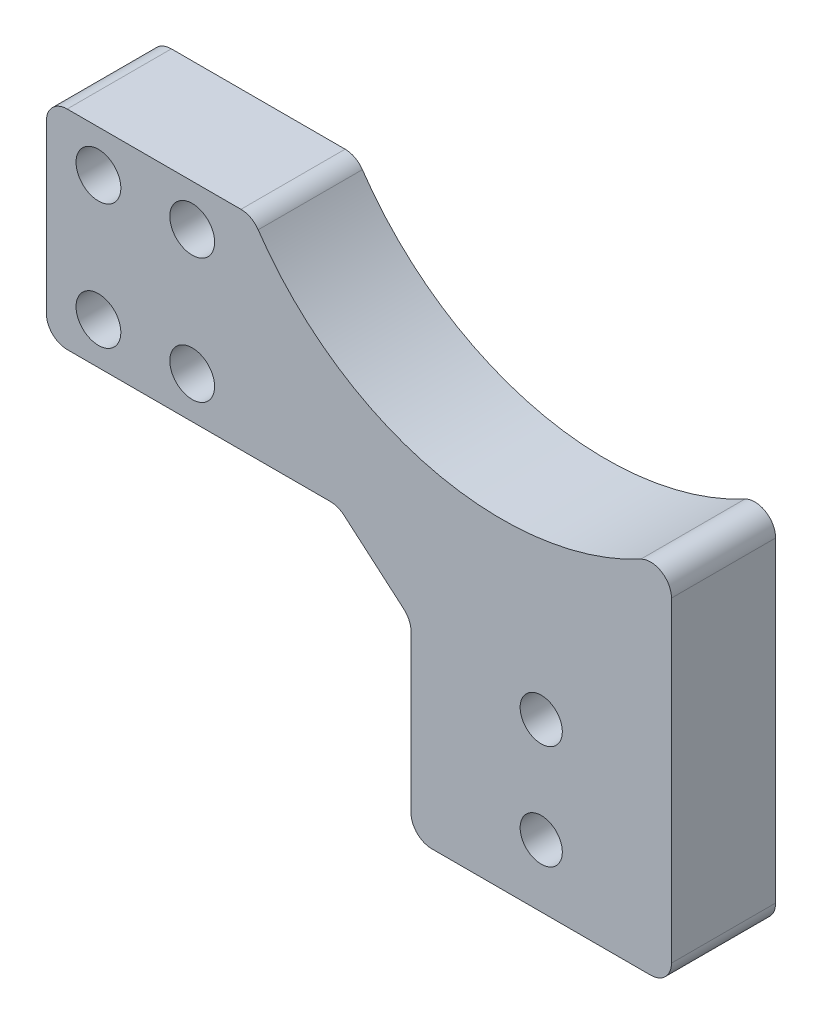
ISO-10303-21;
HEADER;
FILE_DESCRIPTION(('STEP AP214'),'2;1');
FILE_NAME('part.step','',(''),(''),'','','');
FILE_SCHEMA(('AUTOMOTIVE_DESIGN { 1 0 10303 214 1 1 1 1 }'));
ENDSEC;
DATA;
#1=APPLICATION_CONTEXT('core data for automotive mechanical design processes');
#2=APPLICATION_PROTOCOL_DEFINITION('international standard','automotive_design',2000,#1);
#3=PRODUCT_CONTEXT('',#1,'mechanical');
#4=PRODUCT('Part','Part','',(#3));
#5=PRODUCT_RELATED_PRODUCT_CATEGORY('part','',(#4));
#6=PRODUCT_DEFINITION_FORMATION('','',#4);
#7=PRODUCT_DEFINITION_CONTEXT('part definition',#1,'design');
#8=PRODUCT_DEFINITION('design','',#6,#7);
#9=PRODUCT_DEFINITION_SHAPE('','',#8);
#10=(LENGTH_UNIT() NAMED_UNIT(*) SI_UNIT(.MILLI.,.METRE.));
#11=(NAMED_UNIT(*) PLANE_ANGLE_UNIT() SI_UNIT($,.RADIAN.));
#12=(NAMED_UNIT(*) SI_UNIT($,.STERADIAN.) SOLID_ANGLE_UNIT());
#13=UNCERTAINTY_MEASURE_WITH_UNIT(LENGTH_MEASURE(1.E-05),#10,'distance_accuracy_value','');
#14=(GEOMETRIC_REPRESENTATION_CONTEXT(3) GLOBAL_UNCERTAINTY_ASSIGNED_CONTEXT((#13)) GLOBAL_UNIT_ASSIGNED_CONTEXT((#10,
#11,#12)) REPRESENTATION_CONTEXT('',''));
#15=CARTESIAN_POINT('',(0.,0.,0.));
#16=DIRECTION('',(0.,0.,1.));
#17=DIRECTION('',(1.,0.,0.));
#18=AXIS2_PLACEMENT_3D('',#15,#16,#17);
#19=CARTESIAN_POINT('',(-7.,6.,5.));
#20=DIRECTION('',(0.650791373455969,0.759256602365296,0.));
#21=DIRECTION('',(-0.759256602365296,0.650791373455969,0.));
#22=AXIS2_PLACEMENT_3D('',#19,#20,#21);
#23=PLANE('',#22);
#24=DIRECTION('',(0.759256602365296,-0.650791373455969,0.));
#25=VECTOR('',#24,1.);
#26=CARTESIAN_POINT('',(-7.,6.,5.));
#27=LINE('',#26,#25);
#28=CARTESIAN_POINT('',(-6.43826540551902,5.51851320473059,5.));
#29=VERTEX_POINT('',#28);
#30=CARTESIAN_POINT('',(-0.698417253088064,0.598643359789769,5.));
#31=VERTEX_POINT('',#30);
#32=EDGE_CURVE('E169',#29,#31,#27,.T.);
#33=ORIENTED_EDGE('',*,*,#32,.F.);
#34=DIRECTION('',(0.,0.,-1.));
#35=VECTOR('',#34,1.);
#36=CARTESIAN_POINT('',(-6.43826540551902,5.51851320473059,-5.));
#37=LINE('',#36,#35);
#38=CARTESIAN_POINT('',(-6.43826540551902,5.51851320473059,-5.));
#39=VERTEX_POINT('',#38);
#40=EDGE_CURVE('E155',#29,#39,#37,.T.);
#41=ORIENTED_EDGE('',*,*,#40,.T.);
#42=DIRECTION('',(0.759256602365296,-0.650791373455969,0.));
#43=VECTOR('',#42,1.);
#44=CARTESIAN_POINT('',(-7.,6.,-5.));
#45=LINE('',#44,#43);
#46=CARTESIAN_POINT('',(-0.698417253088064,0.598643359789769,-5.));
#47=VERTEX_POINT('',#46);
#48=EDGE_CURVE('E166',#39,#47,#45,.T.);
#49=ORIENTED_EDGE('',*,*,#48,.T.);
#50=DIRECTION('',(0.,0.,-1.));
#51=VECTOR('',#50,1.);
#52=CARTESIAN_POINT('',(-0.698417253088063,0.598643359789768,5.));
#53=LINE('',#52,#51);
#54=EDGE_CURVE('E171',#47,#31,#53,.F.);
#55=ORIENTED_EDGE('',*,*,#54,.T.);
#56=EDGE_LOOP('',(#33,#41,#49,#55));
#57=FACE_BOUND('',#56,.T.);
#58=ADVANCED_FACE('F35',(#57),#23,.F.);
#59=CARTESIAN_POINT('',(0.,0.,5.));
#60=DIRECTION('',(1.,0.,0.));
#61=DIRECTION('',(0.,1.,0.));
#62=AXIS2_PLACEMENT_3D('',#59,#60,#61);
#63=PLANE('',#62);
#64=DIRECTION('',(0.,-1.,0.));
#65=VECTOR('',#64,1.);
#66=CARTESIAN_POINT('',(0.,0.,-5.));
#67=LINE('',#66,#65);
#68=CARTESIAN_POINT('',(0.,-0.919869844940825,-5.));
#69=VERTEX_POINT('',#68);
#70=CARTESIAN_POINT('',(0.,-16.,-5.));
#71=VERTEX_POINT('',#70);
#72=EDGE_CURVE('E176',#69,#71,#67,.T.);
#73=ORIENTED_EDGE('',*,*,#72,.T.);
#74=DIRECTION('',(0.,0.,1.));
#75=VECTOR('',#74,1.);
#76=CARTESIAN_POINT('',(0.,-16.,5.));
#77=LINE('',#76,#75);
#78=CARTESIAN_POINT('',(0.,-16.,5.));
#79=VERTEX_POINT('',#78);
#80=EDGE_CURVE('E11',#71,#79,#77,.T.);
#81=ORIENTED_EDGE('',*,*,#80,.T.);
#82=DIRECTION('',(0.,-1.,0.));
#83=VECTOR('',#82,1.);
#84=CARTESIAN_POINT('',(0.,0.,5.));
#85=LINE('',#84,#83);
#86=CARTESIAN_POINT('',(0.,-0.919869844940825,5.));
#87=VERTEX_POINT('',#86);
#88=EDGE_CURVE('E277',#87,#79,#85,.T.);
#89=ORIENTED_EDGE('',*,*,#88,.F.);
#90=DIRECTION('',(0.,0.,-1.));
#91=VECTOR('',#90,1.);
#92=CARTESIAN_POINT('',(0.,-0.919869844940825,-5.));
#93=LINE('',#92,#91);
#94=EDGE_CURVE('E217',#87,#69,#93,.T.);
#95=ORIENTED_EDGE('',*,*,#94,.T.);
#96=EDGE_LOOP('',(#73,#81,#89,#95));
#97=FACE_BOUND('',#96,.T.);
#98=ADVANCED_FACE('F333',(#97),#63,.F.);
#99=CARTESIAN_POINT('',(25.,-24.,5.));
#100=DIRECTION('',(-1.,0.,0.));
#101=DIRECTION('',(0.,-1.,0.));
#102=AXIS2_PLACEMENT_3D('',#99,#100,#101);
#103=PLANE('',#102);
#104=DIRECTION('',(0.,1.,0.));
#105=VECTOR('',#104,1.);
#106=CARTESIAN_POINT('',(25.,-24.,5.));
#107=LINE('',#106,#105);
#108=CARTESIAN_POINT('',(25.,-16.,5.));
#109=VERTEX_POINT('',#108);
#110=CARTESIAN_POINT('',(25.,14.3434342046842,5.));
#111=VERTEX_POINT('',#110);
#112=EDGE_CURVE('E272',#109,#111,#107,.T.);
#113=ORIENTED_EDGE('',*,*,#112,.F.);
#114=DIRECTION('',(0.,0.,1.));
#115=VECTOR('',#114,1.);
#116=CARTESIAN_POINT('',(25.,-16.,5.));
#117=LINE('',#116,#115);
#118=CARTESIAN_POINT('',(25.,-16.,-5.));
#119=VERTEX_POINT('',#118);
#120=EDGE_CURVE('E58',#109,#119,#117,.F.);
#121=ORIENTED_EDGE('',*,*,#120,.T.);
#122=DIRECTION('',(0.,1.,0.));
#123=VECTOR('',#122,1.);
#124=CARTESIAN_POINT('',(25.,-24.,-5.));
#125=LINE('',#124,#123);
#126=CARTESIAN_POINT('',(25.,14.3434342046842,-5.));
#127=VERTEX_POINT('',#126);
#128=EDGE_CURVE('E179',#119,#127,#125,.T.);
#129=ORIENTED_EDGE('',*,*,#128,.T.);
#130=DIRECTION('',(0.,0.,-1.));
#131=VECTOR('',#130,1.);
#132=CARTESIAN_POINT('',(25.,14.3434342046842,5.));
#133=LINE('',#132,#131);
#134=EDGE_CURVE('E236',#127,#111,#133,.F.);
#135=ORIENTED_EDGE('',*,*,#134,.T.);
#136=EDGE_LOOP('',(#113,#121,#129,#135));
#137=FACE_BOUND('',#136,.T.);
#138=ADVANCED_FACE('F273',(#137),#103,.F.);
#139=CARTESIAN_POINT('',(8.70000000000001,41.,5.));
#140=DIRECTION('',(0.,0.,-1.));
#141=DIRECTION('',(-1.,0.,0.));
#142=AXIS2_PLACEMENT_3D('',#139,#140,#141);
#143=CYLINDRICAL_SURFACE('',#142,28.25);
#144=CARTESIAN_POINT('',(8.70000000000001,41.,5.));
#145=DIRECTION('',(0.,0.,-1.));
#146=DIRECTION('',(-1.,0.,0.));
#147=AXIS2_PLACEMENT_3D('',#144,#145,#146);
#148=CIRCLE('',#147,28.25);
#149=CARTESIAN_POINT('',(22.0545454545455,16.1058517779282,5.));
#150=VERTEX_POINT('',#149);
#151=CARTESIAN_POINT('',(-14.6669440523577,25.1239669421488,5.));
#152=VERTEX_POINT('',#151);
#153=EDGE_CURVE('E276',#150,#152,#148,.T.);
#154=ORIENTED_EDGE('',*,*,#153,.F.);
#155=DIRECTION('',(0.,0.,-1.));
#156=VECTOR('',#155,1.);
#157=CARTESIAN_POINT('',(22.0545454545455,16.1058517779282,5.));
#158=LINE('',#157,#156);
#159=CARTESIAN_POINT('',(22.0545454545455,16.1058517779282,-5.));
#160=VERTEX_POINT('',#159);
#161=EDGE_CURVE('E228',#150,#160,#158,.T.);
#162=ORIENTED_EDGE('',*,*,#161,.T.);
#163=CARTESIAN_POINT('',(8.70000000000001,41.,-5.));
#164=DIRECTION('',(0.,0.,-1.));
#165=DIRECTION('',(-1.,0.,0.));
#166=AXIS2_PLACEMENT_3D('',#163,#164,#165);
#167=CIRCLE('',#166,28.25);
#168=CARTESIAN_POINT('',(-14.6669440523577,25.1239669421488,-5.));
#169=VERTEX_POINT('',#168);
#170=EDGE_CURVE('E189',#160,#169,#167,.T.);
#171=ORIENTED_EDGE('',*,*,#170,.T.);
#172=DIRECTION('',(0.,0.,-1.));
#173=VECTOR('',#172,1.);
#174=CARTESIAN_POINT('',(-14.6669440523577,25.1239669421488,5.));
#175=LINE('',#174,#173);
#176=EDGE_CURVE('E226',#169,#152,#175,.F.);
#177=ORIENTED_EDGE('',*,*,#176,.T.);
#178=EDGE_LOOP('',(#154,#162,#171,#177));
#179=FACE_BOUND('',#178,.T.);
#180=ADVANCED_FACE('F318',(#179),#143,.F.);
#181=CARTESIAN_POINT('',(-15.2387238590531,26.,5.));
#182=DIRECTION('',(0.,-1.,0.));
#183=DIRECTION('',(1.,0.,0.));
#184=AXIS2_PLACEMENT_3D('',#181,#182,#183);
#185=PLANE('',#184);
#186=DIRECTION('',(-1.,0.,0.));
#187=VECTOR('',#186,1.);
#188=CARTESIAN_POINT('',(-15.2387238590531,26.,5.));
#189=LINE('',#188,#187);
#190=CARTESIAN_POINT('',(-16.3212409764184,26.,5.));
#191=VERTEX_POINT('',#190);
#192=CARTESIAN_POINT('',(-33.,26.,5.));
#193=VERTEX_POINT('',#192);
#194=EDGE_CURVE('E280',#191,#193,#189,.T.);
#195=ORIENTED_EDGE('',*,*,#194,.F.);
#196=DIRECTION('',(0.,0.,-1.));
#197=VECTOR('',#196,1.);
#198=CARTESIAN_POINT('',(-16.3212409764184,26.,5.));
#199=LINE('',#198,#197);
#200=CARTESIAN_POINT('',(-16.3212409764184,26.,-5.));
#201=VERTEX_POINT('',#200);
#202=EDGE_CURVE('E243',#191,#201,#199,.T.);
#203=ORIENTED_EDGE('',*,*,#202,.T.);
#204=DIRECTION('',(-1.,0.,0.));
#205=VECTOR('',#204,1.);
#206=CARTESIAN_POINT('',(-15.2387238590531,26.,-5.));
#207=LINE('',#206,#205);
#208=CARTESIAN_POINT('',(-33.,26.,-5.));
#209=VERTEX_POINT('',#208);
#210=EDGE_CURVE('E192',#201,#209,#207,.T.);
#211=ORIENTED_EDGE('',*,*,#210,.T.);
#212=DIRECTION('',(0.,0.,-1.));
#213=VECTOR('',#212,1.);
#214=CARTESIAN_POINT('',(-33.,26.,5.));
#215=LINE('',#214,#213);
#216=EDGE_CURVE('E161',#209,#193,#215,.F.);
#217=ORIENTED_EDGE('',*,*,#216,.T.);
#218=EDGE_LOOP('',(#195,#203,#211,#217));
#219=FACE_BOUND('',#218,.T.);
#220=ADVANCED_FACE('F310',(#219),#185,.F.);
#221=CARTESIAN_POINT('',(-35.,26.,5.));
#222=DIRECTION('',(1.,0.,0.));
#223=DIRECTION('',(0.,1.,0.));
#224=AXIS2_PLACEMENT_3D('',#221,#222,#223);
#225=PLANE('',#224);
#226=DIRECTION('',(0.,-1.,0.));
#227=VECTOR('',#226,1.);
#228=CARTESIAN_POINT('',(-35.,26.,-5.));
#229=LINE('',#228,#227);
#230=CARTESIAN_POINT('',(-35.,24.,-5.));
#231=VERTEX_POINT('',#230);
#232=CARTESIAN_POINT('',(-35.,8.,-5.));
#233=VERTEX_POINT('',#232);
#234=EDGE_CURVE('E194',#231,#233,#229,.T.);
#235=ORIENTED_EDGE('',*,*,#234,.T.);
#236=DIRECTION('',(0.,0.,-1.));
#237=VECTOR('',#236,1.);
#238=CARTESIAN_POINT('',(-35.,8.,5.));
#239=LINE('',#238,#237);
#240=CARTESIAN_POINT('',(-35.,8.,5.));
#241=VERTEX_POINT('',#240);
#242=EDGE_CURVE('E211',#233,#241,#239,.F.);
#243=ORIENTED_EDGE('',*,*,#242,.T.);
#244=DIRECTION('',(0.,-1.,0.));
#245=VECTOR('',#244,1.);
#246=CARTESIAN_POINT('',(-35.,26.,5.));
#247=LINE('',#246,#245);
#248=CARTESIAN_POINT('',(-35.,24.,5.));
#249=VERTEX_POINT('',#248);
#250=EDGE_CURVE('E286',#249,#241,#247,.T.);
#251=ORIENTED_EDGE('',*,*,#250,.F.);
#252=DIRECTION('',(0.,0.,-1.));
#253=VECTOR('',#252,1.);
#254=CARTESIAN_POINT('',(-35.,24.,5.));
#255=LINE('',#254,#253);
#256=EDGE_CURVE('E208',#249,#231,#255,.T.);
#257=ORIENTED_EDGE('',*,*,#256,.T.);
#258=EDGE_LOOP('',(#235,#243,#251,#257));
#259=FACE_BOUND('',#258,.T.);
#260=ADVANCED_FACE('F300',(#259),#225,.F.);
#261=CARTESIAN_POINT('',(-35.,6.,5.));
#262=DIRECTION('',(0.,1.,0.));
#263=DIRECTION('',(0.,0.,1.));
#264=AXIS2_PLACEMENT_3D('',#261,#262,#263);
#265=PLANE('',#264);
#266=DIRECTION('',(1.,0.,0.));
#267=VECTOR('',#266,1.);
#268=CARTESIAN_POINT('',(-35.,6.,-5.));
#269=LINE('',#268,#267);
#270=CARTESIAN_POINT('',(-33.,6.,-5.));
#271=VERTEX_POINT('',#270);
#272=CARTESIAN_POINT('',(-7.73984815243096,6.,-5.));
#273=VERTEX_POINT('',#272);
#274=EDGE_CURVE('E197',#271,#273,#269,.T.);
#275=ORIENTED_EDGE('',*,*,#274,.T.);
#276=DIRECTION('',(0.,0.,-1.));
#277=VECTOR('',#276,1.);
#278=CARTESIAN_POINT('',(-7.73984815243096,6.,5.));
#279=LINE('',#278,#277);
#280=CARTESIAN_POINT('',(-7.73984815243096,6.,5.));
#281=VERTEX_POINT('',#280);
#282=EDGE_CURVE('E156',#273,#281,#279,.F.);
#283=ORIENTED_EDGE('',*,*,#282,.T.);
#284=DIRECTION('',(1.,0.,0.));
#285=VECTOR('',#284,1.);
#286=CARTESIAN_POINT('',(-35.,6.,5.));
#287=LINE('',#286,#285);
#288=CARTESIAN_POINT('',(-33.,6.,5.));
#289=VERTEX_POINT('',#288);
#290=EDGE_CURVE('E185',#289,#281,#287,.T.);
#291=ORIENTED_EDGE('',*,*,#290,.F.);
#292=DIRECTION('',(0.,0.,-1.));
#293=VECTOR('',#292,1.);
#294=CARTESIAN_POINT('',(-33.,6.,5.));
#295=LINE('',#294,#293);
#296=EDGE_CURVE('E170',#289,#271,#295,.T.);
#297=ORIENTED_EDGE('',*,*,#296,.T.);
#298=EDGE_LOOP('',(#275,#283,#291,#297));
#299=FACE_BOUND('',#298,.T.);
#300=ADVANCED_FACE('F294',(#299),#265,.F.);
#301=CARTESIAN_POINT('',(8.70000000000001,41.,5.));
#302=DIRECTION('',(0.,0.,-1.));
#303=DIRECTION('',(-1.,0.,0.));
#304=AXIS2_PLACEMENT_3D('',#301,#302,#303);
#305=PLANE('',#304);
#306=CARTESIAN_POINT('',(-21.,10.,5.));
#307=DIRECTION('',(0.,0.,1.));
#308=DIRECTION('',(1.,0.,0.));
#309=AXIS2_PLACEMENT_3D('',#306,#307,#308);
#310=CIRCLE('',#309,2.15);
#311=CARTESIAN_POINT('',(-18.85,10.,5.));
#312=VERTEX_POINT('',#311);
#313=EDGE_CURVE('E534',#312,#312,#310,.T.);
#314=ORIENTED_EDGE('',*,*,#313,.F.);
#315=EDGE_LOOP('',(#314));
#316=FACE_BOUND('',#315,.T.);
#317=CARTESIAN_POINT('',(-21.,22.,5.));
#318=DIRECTION('',(0.,0.,1.));
#319=DIRECTION('',(1.,0.,0.));
#320=AXIS2_PLACEMENT_3D('',#317,#318,#319);
#321=CIRCLE('',#320,2.15);
#322=CARTESIAN_POINT('',(-18.85,22.,5.));
#323=VERTEX_POINT('',#322);
#324=EDGE_CURVE('E540',#323,#323,#321,.T.);
#325=ORIENTED_EDGE('',*,*,#324,.F.);
#326=EDGE_LOOP('',(#325));
#327=FACE_BOUND('',#326,.T.);
#328=CARTESIAN_POINT('',(-30.,22.,5.));
#329=DIRECTION('',(0.,0.,-1.));
#330=DIRECTION('',(-1.,0.,0.));
#331=AXIS2_PLACEMENT_3D('',#328,#329,#330);
#332=CIRCLE('',#331,2.15);
#333=CARTESIAN_POINT('',(-32.15,22.,5.));
#334=VERTEX_POINT('',#333);
#335=EDGE_CURVE('E355',#334,#334,#332,.T.);
#336=ORIENTED_EDGE('',*,*,#335,.T.);
#337=EDGE_LOOP('',(#336));
#338=FACE_BOUND('',#337,.T.);
#339=CARTESIAN_POINT('',(-30.,10.,5.));
#340=DIRECTION('',(0.,0.,-1.));
#341=DIRECTION('',(-1.,0.,0.));
#342=AXIS2_PLACEMENT_3D('',#339,#340,#341);
#343=CIRCLE('',#342,2.15);
#344=CARTESIAN_POINT('',(-32.15,10.,5.));
#345=VERTEX_POINT('',#344);
#346=EDGE_CURVE('E358',#345,#345,#343,.T.);
#347=ORIENTED_EDGE('',*,*,#346,.T.);
#348=EDGE_LOOP('',(#347));
#349=FACE_BOUND('',#348,.T.);
#350=CARTESIAN_POINT('',(12.5,-2.,5.));
#351=DIRECTION('',(0.,0.,1.));
#352=DIRECTION('',(1.,0.,0.));
#353=AXIS2_PLACEMENT_3D('',#350,#351,#352);
#354=CIRCLE('',#353,2.025);
#355=CARTESIAN_POINT('',(14.525,-2.,5.));
#356=VERTEX_POINT('',#355);
#357=EDGE_CURVE('E182',#356,#356,#354,.T.);
#358=ORIENTED_EDGE('',*,*,#357,.F.);
#359=EDGE_LOOP('',(#358));
#360=FACE_BOUND('',#359,.T.);
#361=CARTESIAN_POINT('',(12.5,-12.,5.));
#362=DIRECTION('',(0.,0.,1.));
#363=DIRECTION('',(1.,0.,0.));
#364=AXIS2_PLACEMENT_3D('',#361,#362,#363);
#365=CIRCLE('',#364,2.025);
#366=CARTESIAN_POINT('',(14.525,-12.,5.));
#367=VERTEX_POINT('',#366);
#368=EDGE_CURVE('E266',#367,#367,#365,.T.);
#369=ORIENTED_EDGE('',*,*,#368,.F.);
#370=EDGE_LOOP('',(#369));
#371=FACE_BOUND('',#370,.T.);
#372=DIRECTION('',(-1.,0.,0.));
#373=VECTOR('',#372,1.);
#374=CARTESIAN_POINT('',(0.,-18.,5.));
#375=LINE('',#374,#373);
#376=CARTESIAN_POINT('',(23.,-18.,5.));
#377=VERTEX_POINT('',#376);
#378=CARTESIAN_POINT('',(1.99999999999999,-18.,5.));
#379=VERTEX_POINT('',#378);
#380=EDGE_CURVE('E267',#377,#379,#375,.T.);
#381=ORIENTED_EDGE('',*,*,#380,.F.);
#382=CARTESIAN_POINT('',(23.,-16.,5.));
#383=DIRECTION('',(0.,0.,-1.));
#384=DIRECTION('',(-1.,0.,0.));
#385=AXIS2_PLACEMENT_3D('',#382,#383,#384);
#386=CIRCLE('',#385,2.);
#387=EDGE_CURVE('E253',#377,#109,#386,.F.);
#388=ORIENTED_EDGE('',*,*,#387,.T.);
#389=ORIENTED_EDGE('',*,*,#112,.T.);
#390=CARTESIAN_POINT('',(23.,14.3434342046842,5.));
#391=DIRECTION('',(0.,0.,-1.));
#392=DIRECTION('',(-1.,0.,0.));
#393=AXIS2_PLACEMENT_3D('',#390,#391,#392);
#394=CIRCLE('',#393,2.);
#395=EDGE_CURVE('E241',#111,#150,#394,.F.);
#396=ORIENTED_EDGE('',*,*,#395,.T.);
#397=ORIENTED_EDGE('',*,*,#153,.T.);
#398=CARTESIAN_POINT('',(-16.3212409764184,24.,5.));
#399=DIRECTION('',(0.,0.,-1.));
#400=DIRECTION('',(-1.,0.,0.));
#401=AXIS2_PLACEMENT_3D('',#398,#399,#400);
#402=CIRCLE('',#401,2.);
#403=EDGE_CURVE('E239',#152,#191,#402,.F.);
#404=ORIENTED_EDGE('',*,*,#403,.T.);
#405=ORIENTED_EDGE('',*,*,#194,.T.);
#406=CARTESIAN_POINT('',(-33.,24.,5.));
#407=DIRECTION('',(0.,0.,-1.));
#408=DIRECTION('',(-1.,0.,0.));
#409=AXIS2_PLACEMENT_3D('',#406,#407,#408);
#410=CIRCLE('',#409,2.);
#411=EDGE_CURVE('E213',#193,#249,#410,.F.);
#412=ORIENTED_EDGE('',*,*,#411,.T.);
#413=ORIENTED_EDGE('',*,*,#250,.T.);
#414=CARTESIAN_POINT('',(-33.,8.,5.));
#415=DIRECTION('',(0.,0.,-1.));
#416=DIRECTION('',(-1.,0.,0.));
#417=AXIS2_PLACEMENT_3D('',#414,#415,#416);
#418=CIRCLE('',#417,2.);
#419=EDGE_CURVE('E215',#241,#289,#418,.F.);
#420=ORIENTED_EDGE('',*,*,#419,.T.);
#421=ORIENTED_EDGE('',*,*,#290,.T.);
#422=CARTESIAN_POINT('',(-7.73984815243096,4.,5.));
#423=DIRECTION('',(0.,0.,-1.));
#424=DIRECTION('',(-1.,0.,0.));
#425=AXIS2_PLACEMENT_3D('',#422,#423,#424);
#426=CIRCLE('',#425,2.);
#427=EDGE_CURVE('E160',#281,#29,#426,.T.);
#428=ORIENTED_EDGE('',*,*,#427,.T.);
#429=ORIENTED_EDGE('',*,*,#32,.T.);
#430=CARTESIAN_POINT('',(-2.,-0.919869844940825,5.));
#431=DIRECTION('',(0.,0.,-1.));
#432=DIRECTION('',(-1.,0.,0.));
#433=AXIS2_PLACEMENT_3D('',#430,#431,#432);
#434=CIRCLE('',#433,2.);
#435=EDGE_CURVE('E224',#31,#87,#434,.T.);
#436=ORIENTED_EDGE('',*,*,#435,.T.);
#437=ORIENTED_EDGE('',*,*,#88,.T.);
#438=CARTESIAN_POINT('',(1.99999999999999,-16.,5.));
#439=DIRECTION('',(0.,0.,-1.));
#440=DIRECTION('',(-1.,0.,0.));
#441=AXIS2_PLACEMENT_3D('',#438,#439,#440);
#442=CIRCLE('',#441,2.);
#443=EDGE_CURVE('E251',#79,#379,#442,.F.);
#444=ORIENTED_EDGE('',*,*,#443,.T.);
#445=EDGE_LOOP('',(#381,#388,#389,#396,#397,#404,#405,#412,#413,#420,#421,#428,#429,#436,#437,#444));
#446=FACE_BOUND('',#445,.T.);
#447=ADVANCED_FACE('F271',(#316,#327,#338,#349,#360,#371,#446),#305,.F.);
#448=CARTESIAN_POINT('',(8.70000000000001,41.,-5.));
#449=DIRECTION('',(0.,0.,-1.));
#450=DIRECTION('',(-1.,0.,0.));
#451=AXIS2_PLACEMENT_3D('',#448,#449,#450);
#452=PLANE('',#451);
#453=CARTESIAN_POINT('',(-21.,10.,-5.));
#454=DIRECTION('',(0.,0.,1.));
#455=DIRECTION('',(1.,0.,0.));
#456=AXIS2_PLACEMENT_3D('',#453,#454,#455);
#457=CIRCLE('',#456,2.15);
#458=CARTESIAN_POINT('',(-18.85,10.,-5.));
#459=VERTEX_POINT('',#458);
#460=EDGE_CURVE('E532',#459,#459,#457,.T.);
#461=ORIENTED_EDGE('',*,*,#460,.T.);
#462=EDGE_LOOP('',(#461));
#463=FACE_BOUND('',#462,.T.);
#464=CARTESIAN_POINT('',(-21.,22.,-5.));
#465=DIRECTION('',(0.,0.,1.));
#466=DIRECTION('',(1.,0.,0.));
#467=AXIS2_PLACEMENT_3D('',#464,#465,#466);
#468=CIRCLE('',#467,2.15);
#469=CARTESIAN_POINT('',(-18.85,22.,-5.));
#470=VERTEX_POINT('',#469);
#471=EDGE_CURVE('E535',#470,#470,#468,.T.);
#472=ORIENTED_EDGE('',*,*,#471,.T.);
#473=EDGE_LOOP('',(#472));
#474=FACE_BOUND('',#473,.T.);
#475=CARTESIAN_POINT('',(-30.,22.,-5.));
#476=DIRECTION('',(0.,0.,1.));
#477=DIRECTION('',(1.,0.,0.));
#478=AXIS2_PLACEMENT_3D('',#475,#476,#477);
#479=CIRCLE('',#478,2.15);
#480=CARTESIAN_POINT('',(-27.85,22.,-5.));
#481=VERTEX_POINT('',#480);
#482=EDGE_CURVE('E545',#481,#481,#479,.T.);
#483=ORIENTED_EDGE('',*,*,#482,.T.);
#484=EDGE_LOOP('',(#483));
#485=FACE_BOUND('',#484,.T.);
#486=CARTESIAN_POINT('',(-30.,10.,-5.));
#487=DIRECTION('',(0.,0.,1.));
#488=DIRECTION('',(1.,0.,0.));
#489=AXIS2_PLACEMENT_3D('',#486,#487,#488);
#490=CIRCLE('',#489,2.15);
#491=CARTESIAN_POINT('',(-27.85,10.,-5.));
#492=VERTEX_POINT('',#491);
#493=EDGE_CURVE('E537',#492,#492,#490,.T.);
#494=ORIENTED_EDGE('',*,*,#493,.T.);
#495=EDGE_LOOP('',(#494));
#496=FACE_BOUND('',#495,.T.);
#497=ORIENTED_EDGE('',*,*,#128,.F.);
#498=CARTESIAN_POINT('',(23.,-16.,-5.));
#499=DIRECTION('',(0.,0.,-1.));
#500=DIRECTION('',(-1.,0.,0.));
#501=AXIS2_PLACEMENT_3D('',#498,#499,#500);
#502=CIRCLE('',#501,2.);
#503=CARTESIAN_POINT('',(23.,-18.,-5.));
#504=VERTEX_POINT('',#503);
#505=EDGE_CURVE('E43',#119,#504,#502,.T.);
#506=ORIENTED_EDGE('',*,*,#505,.T.);
#507=DIRECTION('',(-1.,0.,0.));
#508=VECTOR('',#507,1.);
#509=CARTESIAN_POINT('',(0.,-18.,-5.));
#510=LINE('',#509,#508);
#511=CARTESIAN_POINT('',(1.99999999999999,-18.,-5.));
#512=VERTEX_POINT('',#511);
#513=EDGE_CURVE('E258',#504,#512,#510,.T.);
#514=ORIENTED_EDGE('',*,*,#513,.T.);
#515=CARTESIAN_POINT('',(1.99999999999999,-16.,-5.));
#516=DIRECTION('',(0.,0.,-1.));
#517=DIRECTION('',(-1.,0.,0.));
#518=AXIS2_PLACEMENT_3D('',#515,#516,#517);
#519=CIRCLE('',#518,2.);
#520=EDGE_CURVE('E50',#512,#71,#519,.T.);
#521=ORIENTED_EDGE('',*,*,#520,.T.);
#522=ORIENTED_EDGE('',*,*,#72,.F.);
#523=CARTESIAN_POINT('',(-2.,-0.919869844940825,-5.));
#524=DIRECTION('',(0.,0.,-1.));
#525=DIRECTION('',(-1.,0.,0.));
#526=AXIS2_PLACEMENT_3D('',#523,#524,#525);
#527=CIRCLE('',#526,2.);
#528=EDGE_CURVE('E175',#69,#47,#527,.F.);
#529=ORIENTED_EDGE('',*,*,#528,.T.);
#530=ORIENTED_EDGE('',*,*,#48,.F.);
#531=CARTESIAN_POINT('',(-7.73984815243096,4.,-5.));
#532=DIRECTION('',(0.,0.,-1.));
#533=DIRECTION('',(-1.,0.,0.));
#534=AXIS2_PLACEMENT_3D('',#531,#532,#533);
#535=CIRCLE('',#534,2.);
#536=EDGE_CURVE('E151',#39,#273,#535,.F.);
#537=ORIENTED_EDGE('',*,*,#536,.T.);
#538=ORIENTED_EDGE('',*,*,#274,.F.);
#539=CARTESIAN_POINT('',(-33.,8.,-5.));
#540=DIRECTION('',(0.,0.,-1.));
#541=DIRECTION('',(-1.,0.,0.));
#542=AXIS2_PLACEMENT_3D('',#539,#540,#541);
#543=CIRCLE('',#542,2.);
#544=EDGE_CURVE('E206',#271,#233,#543,.T.);
#545=ORIENTED_EDGE('',*,*,#544,.T.);
#546=ORIENTED_EDGE('',*,*,#234,.F.);
#547=CARTESIAN_POINT('',(-33.,24.,-5.));
#548=DIRECTION('',(0.,0.,-1.));
#549=DIRECTION('',(-1.,0.,0.));
#550=AXIS2_PLACEMENT_3D('',#547,#548,#549);
#551=CIRCLE('',#550,2.);
#552=EDGE_CURVE('E203',#231,#209,#551,.T.);
#553=ORIENTED_EDGE('',*,*,#552,.T.);
#554=ORIENTED_EDGE('',*,*,#210,.F.);
#555=CARTESIAN_POINT('',(-16.3212409764184,24.,-5.));
#556=DIRECTION('',(0.,0.,-1.));
#557=DIRECTION('',(-1.,0.,0.));
#558=AXIS2_PLACEMENT_3D('',#555,#556,#557);
#559=CIRCLE('',#558,2.);
#560=EDGE_CURVE('E231',#201,#169,#559,.T.);
#561=ORIENTED_EDGE('',*,*,#560,.T.);
#562=ORIENTED_EDGE('',*,*,#170,.F.);
#563=CARTESIAN_POINT('',(23.,14.3434342046842,-5.));
#564=DIRECTION('',(0.,0.,-1.));
#565=DIRECTION('',(-1.,0.,0.));
#566=AXIS2_PLACEMENT_3D('',#563,#564,#565);
#567=CIRCLE('',#566,2.);
#568=EDGE_CURVE('E233',#160,#127,#567,.T.);
#569=ORIENTED_EDGE('',*,*,#568,.T.);
#570=EDGE_LOOP('',(#497,#506,#514,#521,#522,#529,#530,#537,#538,#545,#546,#553,#554,#561,#562,#569));
#571=FACE_BOUND('',#570,.T.);
#572=CARTESIAN_POINT('',(12.5,-2.,-5.));
#573=DIRECTION('',(0.,0.,1.));
#574=DIRECTION('',(1.,0.,0.));
#575=AXIS2_PLACEMENT_3D('',#572,#573,#574);
#576=CIRCLE('',#575,2.025);
#577=CARTESIAN_POINT('',(14.525,-2.,-5.));
#578=VERTEX_POINT('',#577);
#579=EDGE_CURVE('E177',#578,#578,#576,.T.);
#580=ORIENTED_EDGE('',*,*,#579,.T.);
#581=EDGE_LOOP('',(#580));
#582=FACE_BOUND('',#581,.T.);
#583=CARTESIAN_POINT('',(12.5,-12.,-5.));
#584=DIRECTION('',(0.,0.,1.));
#585=DIRECTION('',(1.,0.,0.));
#586=AXIS2_PLACEMENT_3D('',#583,#584,#585);
#587=CIRCLE('',#586,2.025);
#588=CARTESIAN_POINT('',(14.525,-12.,-5.));
#589=VERTEX_POINT('',#588);
#590=EDGE_CURVE('E363',#589,#589,#587,.T.);
#591=ORIENTED_EDGE('',*,*,#590,.T.);
#592=EDGE_LOOP('',(#591));
#593=FACE_BOUND('',#592,.T.);
#594=ADVANCED_FACE('F173',(#463,#474,#485,#496,#571,#582,#593),#452,.T.);
#595=CARTESIAN_POINT('',(-7.73984815243096,4.,5.));
#596=DIRECTION('',(0.,0.,1.));
#597=DIRECTION('',(1.,0.,0.));
#598=AXIS2_PLACEMENT_3D('',#595,#596,#597);
#599=CYLINDRICAL_SURFACE('',#598,2.);
#600=ORIENTED_EDGE('',*,*,#427,.F.);
#601=ORIENTED_EDGE('',*,*,#282,.F.);
#602=ORIENTED_EDGE('',*,*,#536,.F.);
#603=ORIENTED_EDGE('',*,*,#40,.F.);
#604=EDGE_LOOP('',(#600,#601,#602,#603));
#605=FACE_BOUND('',#604,.T.);
#606=ADVANCED_FACE('F154',(#605),#599,.F.);
#607=CARTESIAN_POINT('',(-33.,8.,5.));
#608=DIRECTION('',(0.,0.,-1.));
#609=DIRECTION('',(-1.,0.,0.));
#610=AXIS2_PLACEMENT_3D('',#607,#608,#609);
#611=CYLINDRICAL_SURFACE('',#610,2.);
#612=ORIENTED_EDGE('',*,*,#419,.F.);
#613=ORIENTED_EDGE('',*,*,#242,.F.);
#614=ORIENTED_EDGE('',*,*,#544,.F.);
#615=ORIENTED_EDGE('',*,*,#296,.F.);
#616=EDGE_LOOP('',(#612,#613,#614,#615));
#617=FACE_BOUND('',#616,.T.);
#618=ADVANCED_FACE('F296',(#617),#611,.T.);
#619=CARTESIAN_POINT('',(-2.,-0.919869844940825,5.));
#620=DIRECTION('',(0.,0.,1.));
#621=DIRECTION('',(1.,0.,0.));
#622=AXIS2_PLACEMENT_3D('',#619,#620,#621);
#623=CYLINDRICAL_SURFACE('',#622,2.);
#624=ORIENTED_EDGE('',*,*,#435,.F.);
#625=ORIENTED_EDGE('',*,*,#54,.F.);
#626=ORIENTED_EDGE('',*,*,#528,.F.);
#627=ORIENTED_EDGE('',*,*,#94,.F.);
#628=EDGE_LOOP('',(#624,#625,#626,#627));
#629=FACE_BOUND('',#628,.T.);
#630=ADVANCED_FACE('F330',(#629),#623,.F.);
#631=CARTESIAN_POINT('',(-33.,24.,5.));
#632=DIRECTION('',(0.,0.,-1.));
#633=DIRECTION('',(-1.,0.,0.));
#634=AXIS2_PLACEMENT_3D('',#631,#632,#633);
#635=CYLINDRICAL_SURFACE('',#634,2.);
#636=ORIENTED_EDGE('',*,*,#411,.F.);
#637=ORIENTED_EDGE('',*,*,#216,.F.);
#638=ORIENTED_EDGE('',*,*,#552,.F.);
#639=ORIENTED_EDGE('',*,*,#256,.F.);
#640=EDGE_LOOP('',(#636,#637,#638,#639));
#641=FACE_BOUND('',#640,.T.);
#642=ADVANCED_FACE('F304',(#641),#635,.T.);
#643=CARTESIAN_POINT('',(23.,14.3434342046842,5.));
#644=DIRECTION('',(0.,0.,-1.));
#645=DIRECTION('',(-1.,0.,0.));
#646=AXIS2_PLACEMENT_3D('',#643,#644,#645);
#647=CYLINDRICAL_SURFACE('',#646,2.);
#648=ORIENTED_EDGE('',*,*,#395,.F.);
#649=ORIENTED_EDGE('',*,*,#134,.F.);
#650=ORIENTED_EDGE('',*,*,#568,.F.);
#651=ORIENTED_EDGE('',*,*,#161,.F.);
#652=EDGE_LOOP('',(#648,#649,#650,#651));
#653=FACE_BOUND('',#652,.T.);
#654=ADVANCED_FACE('F321',(#653),#647,.T.);
#655=CARTESIAN_POINT('',(-16.3212409764184,24.,5.));
#656=DIRECTION('',(0.,0.,-1.));
#657=DIRECTION('',(-1.,0.,0.));
#658=AXIS2_PLACEMENT_3D('',#655,#656,#657);
#659=CYLINDRICAL_SURFACE('',#658,2.);
#660=ORIENTED_EDGE('',*,*,#403,.F.);
#661=ORIENTED_EDGE('',*,*,#176,.F.);
#662=ORIENTED_EDGE('',*,*,#560,.F.);
#663=ORIENTED_EDGE('',*,*,#202,.F.);
#664=EDGE_LOOP('',(#660,#661,#662,#663));
#665=FACE_BOUND('',#664,.T.);
#666=ADVANCED_FACE('F314',(#665),#659,.T.);
#667=CARTESIAN_POINT('',(12.5,-12.,-5.));
#668=DIRECTION('',(0.,0.,1.));
#669=DIRECTION('',(1.,0.,0.));
#670=AXIS2_PLACEMENT_3D('',#667,#668,#669);
#671=CYLINDRICAL_SURFACE('',#670,2.025);
#672=ORIENTED_EDGE('',*,*,#590,.F.);
#673=EDGE_LOOP('',(#672));
#674=FACE_BOUND('',#673,.T.);
#675=ORIENTED_EDGE('',*,*,#368,.T.);
#676=EDGE_LOOP('',(#675));
#677=FACE_BOUND('',#676,.T.);
#678=ADVANCED_FACE('F328',(#674,#677),#671,.F.);
#679=CARTESIAN_POINT('',(12.5,-2.,-5.));
#680=DIRECTION('',(0.,0.,1.));
#681=DIRECTION('',(1.,0.,0.));
#682=AXIS2_PLACEMENT_3D('',#679,#680,#681);
#683=CYLINDRICAL_SURFACE('',#682,2.025);
#684=ORIENTED_EDGE('',*,*,#579,.F.);
#685=EDGE_LOOP('',(#684));
#686=FACE_BOUND('',#685,.T.);
#687=ORIENTED_EDGE('',*,*,#357,.T.);
#688=EDGE_LOOP('',(#687));
#689=FACE_BOUND('',#688,.T.);
#690=ADVANCED_FACE('F455',(#686,#689),#683,.F.);
#691=CARTESIAN_POINT('',(0.,-18.,-5.));
#692=DIRECTION('',(0.,1.,0.));
#693=DIRECTION('',(0.,0.,1.));
#694=AXIS2_PLACEMENT_3D('',#691,#692,#693);
#695=PLANE('',#694);
#696=ORIENTED_EDGE('',*,*,#513,.F.);
#697=DIRECTION('',(0.,0.,1.));
#698=VECTOR('',#697,1.);
#699=CARTESIAN_POINT('',(23.,-18.,-5.));
#700=LINE('',#699,#698);
#701=EDGE_CURVE('E248',#504,#377,#700,.T.);
#702=ORIENTED_EDGE('',*,*,#701,.T.);
#703=ORIENTED_EDGE('',*,*,#380,.T.);
#704=DIRECTION('',(0.,0.,1.));
#705=VECTOR('',#704,1.);
#706=CARTESIAN_POINT('',(1.99999999999999,-18.,-5.));
#707=LINE('',#706,#705);
#708=EDGE_CURVE('E246',#379,#512,#707,.F.);
#709=ORIENTED_EDGE('',*,*,#708,.T.);
#710=EDGE_LOOP('',(#696,#702,#703,#709));
#711=FACE_BOUND('',#710,.T.);
#712=ADVANCED_FACE('F262',(#711),#695,.F.);
#713=CARTESIAN_POINT('',(23.,-16.,-5.));
#714=DIRECTION('',(0.,0.,1.));
#715=DIRECTION('',(1.,0.,0.));
#716=AXIS2_PLACEMENT_3D('',#713,#714,#715);
#717=CYLINDRICAL_SURFACE('',#716,2.);
#718=ORIENTED_EDGE('',*,*,#505,.F.);
#719=ORIENTED_EDGE('',*,*,#120,.F.);
#720=ORIENTED_EDGE('',*,*,#387,.F.);
#721=ORIENTED_EDGE('',*,*,#701,.F.);
#722=EDGE_LOOP('',(#718,#719,#720,#721));
#723=FACE_BOUND('',#722,.T.);
#724=ADVANCED_FACE('F269',(#723),#717,.T.);
#725=CARTESIAN_POINT('',(1.99999999999999,-16.,5.));
#726=DIRECTION('',(0.,0.,1.));
#727=DIRECTION('',(1.,0.,0.));
#728=AXIS2_PLACEMENT_3D('',#725,#726,#727);
#729=CYLINDRICAL_SURFACE('',#728,2.);
#730=ORIENTED_EDGE('',*,*,#520,.F.);
#731=ORIENTED_EDGE('',*,*,#708,.F.);
#732=ORIENTED_EDGE('',*,*,#443,.F.);
#733=ORIENTED_EDGE('',*,*,#80,.F.);
#734=EDGE_LOOP('',(#730,#731,#732,#733));
#735=FACE_BOUND('',#734,.T.);
#736=ADVANCED_FACE('F37',(#735),#729,.T.);
#737=CARTESIAN_POINT('',(-30.,10.,-5.));
#738=DIRECTION('',(0.,0.,1.));
#739=DIRECTION('',(1.,0.,0.));
#740=AXIS2_PLACEMENT_3D('',#737,#738,#739);
#741=CYLINDRICAL_SURFACE('',#740,2.15);
#742=ORIENTED_EDGE('',*,*,#493,.F.);
#743=EDGE_LOOP('',(#742));
#744=FACE_BOUND('',#743,.T.);
#745=ORIENTED_EDGE('',*,*,#346,.F.);
#746=EDGE_LOOP('',(#745));
#747=FACE_BOUND('',#746,.T.);
#748=ADVANCED_FACE('F482',(#744,#747),#741,.F.);
#749=CARTESIAN_POINT('',(-30.,22.,-5.));
#750=DIRECTION('',(0.,0.,1.));
#751=DIRECTION('',(1.,0.,0.));
#752=AXIS2_PLACEMENT_3D('',#749,#750,#751);
#753=CYLINDRICAL_SURFACE('',#752,2.15);
#754=ORIENTED_EDGE('',*,*,#482,.F.);
#755=EDGE_LOOP('',(#754));
#756=FACE_BOUND('',#755,.T.);
#757=ORIENTED_EDGE('',*,*,#335,.F.);
#758=EDGE_LOOP('',(#757));
#759=FACE_BOUND('',#758,.T.);
#760=ADVANCED_FACE('F489',(#756,#759),#753,.F.);
#761=CARTESIAN_POINT('',(-21.,22.,-5.));
#762=DIRECTION('',(0.,0.,1.));
#763=DIRECTION('',(1.,0.,0.));
#764=AXIS2_PLACEMENT_3D('',#761,#762,#763);
#765=CYLINDRICAL_SURFACE('',#764,2.15);
#766=ORIENTED_EDGE('',*,*,#471,.F.);
#767=EDGE_LOOP('',(#766));
#768=FACE_BOUND('',#767,.T.);
#769=ORIENTED_EDGE('',*,*,#324,.T.);
#770=EDGE_LOOP('',(#769));
#771=FACE_BOUND('',#770,.T.);
#772=ADVANCED_FACE('F498',(#768,#771),#765,.F.);
#773=CARTESIAN_POINT('',(-21.,10.,-5.));
#774=DIRECTION('',(0.,0.,1.));
#775=DIRECTION('',(1.,0.,0.));
#776=AXIS2_PLACEMENT_3D('',#773,#774,#775);
#777=CYLINDRICAL_SURFACE('',#776,2.15);
#778=ORIENTED_EDGE('',*,*,#460,.F.);
#779=EDGE_LOOP('',(#778));
#780=FACE_BOUND('',#779,.T.);
#781=ORIENTED_EDGE('',*,*,#313,.T.);
#782=EDGE_LOOP('',(#781));
#783=FACE_BOUND('',#782,.T.);
#784=ADVANCED_FACE('F507',(#780,#783),#777,.F.);
#785=CLOSED_SHELL('',(#58,#98,#138,#180,#220,#260,#300,#447,#594,#606,#618,#630,#642,#654,#666,
#678,#690,#712,#724,#736,#748,#760,#772,#784));
#786=MANIFOLD_SOLID_BREP('B2',#785);
#787=ADVANCED_BREP_SHAPE_REPRESENTATION('',(#18,#786),#14);
#788=SHAPE_DEFINITION_REPRESENTATION(#9,#787);
ENDSEC;
END-ISO-10303-21;
